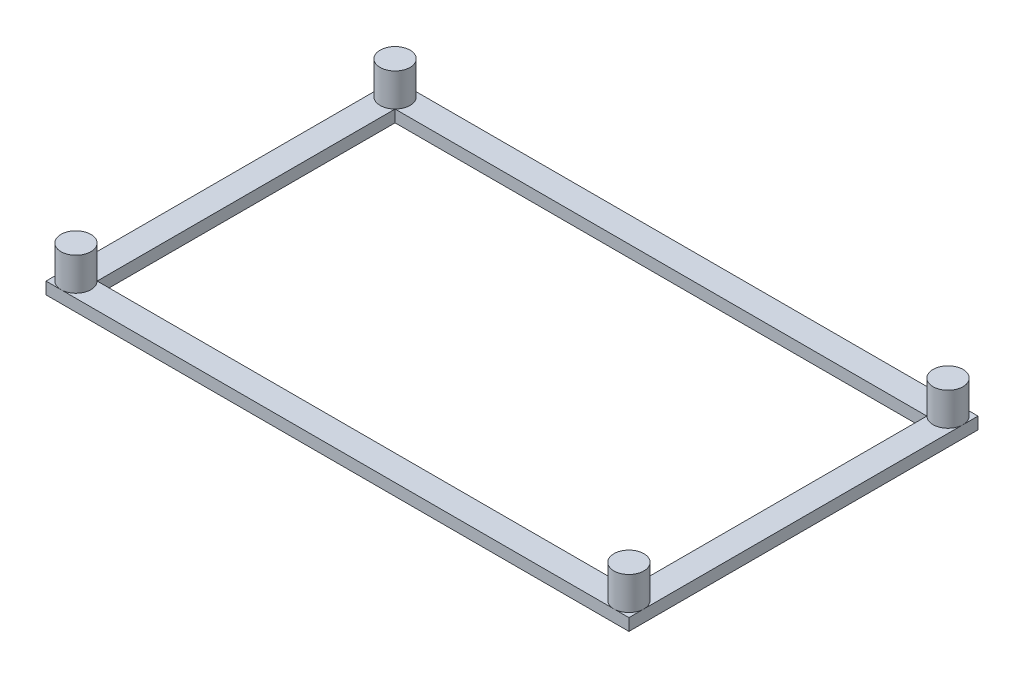
ISO-10303-21;
HEADER;
FILE_DESCRIPTION(('STEP AP214'),'2;1');
FILE_NAME('part.step','',(''),(''),'','','');
FILE_SCHEMA(('AUTOMOTIVE_DESIGN { 1 0 10303 214 1 1 1 1 }'));
ENDSEC;
DATA;
#1=APPLICATION_CONTEXT('core data for automotive mechanical design processes');
#2=APPLICATION_PROTOCOL_DEFINITION('international standard','automotive_design',2000,#1);
#3=PRODUCT_CONTEXT('',#1,'mechanical');
#4=PRODUCT('Part','Part','',(#3));
#5=PRODUCT_RELATED_PRODUCT_CATEGORY('part','',(#4));
#6=PRODUCT_DEFINITION_FORMATION('','',#4);
#7=PRODUCT_DEFINITION_CONTEXT('part definition',#1,'design');
#8=PRODUCT_DEFINITION('design','',#6,#7);
#9=PRODUCT_DEFINITION_SHAPE('','',#8);
#10=(LENGTH_UNIT() NAMED_UNIT(*) SI_UNIT(.MILLI.,.METRE.));
#11=(NAMED_UNIT(*) PLANE_ANGLE_UNIT() SI_UNIT($,.RADIAN.));
#12=(NAMED_UNIT(*) SI_UNIT($,.STERADIAN.) SOLID_ANGLE_UNIT());
#13=UNCERTAINTY_MEASURE_WITH_UNIT(LENGTH_MEASURE(1.E-05),#10,'distance_accuracy_value','');
#14=(GEOMETRIC_REPRESENTATION_CONTEXT(3) GLOBAL_UNCERTAINTY_ASSIGNED_CONTEXT((#13)) GLOBAL_UNIT_ASSIGNED_CONTEXT((#10,
#11,#12)) REPRESENTATION_CONTEXT('',''));
#15=CARTESIAN_POINT('',(0.,0.,0.));
#16=DIRECTION('',(0.,0.,1.));
#17=DIRECTION('',(1.,0.,0.));
#18=AXIS2_PLACEMENT_3D('',#15,#16,#17);
#19=CARTESIAN_POINT('',(0.,2.,0.));
#20=DIRECTION('',(0.,-1.,0.));
#21=DIRECTION('',(0.,0.,-1.));
#22=AXIS2_PLACEMENT_3D('',#19,#20,#21);
#23=PLANE('',#22);
#24=CARTESIAN_POINT('',(92.6585,2.,-115.9685));
#25=DIRECTION('',(0.,-1.,0.));
#26=DIRECTION('',(0.,0.,-1.));
#27=AXIS2_PLACEMENT_3D('',#24,#25,#26);
#28=CIRCLE('',#27,2.5);
#29=CARTESIAN_POINT('',(92.6585,2.,-118.4685));
#30=VERTEX_POINT('',#29);
#31=CARTESIAN_POINT('',(90.8907330470337,2.,-114.200733047034));
#32=VERTEX_POINT('',#31);
#33=EDGE_CURVE('E159',#30,#32,#28,.F.);
#34=ORIENTED_EDGE('',*,*,#33,.F.);
#35=DIRECTION('',(1.,0.,0.));
#36=VECTOR('',#35,1.);
#37=CARTESIAN_POINT('',(-2.15849993599998,2.,-118.4685));
#38=LINE('',#37,#36);
#39=CARTESIAN_POINT('',(0.341500064000022,2.,-118.4685));
#40=VERTEX_POINT('',#39);
#41=EDGE_CURVE('E140',#40,#30,#38,.T.);
#42=ORIENTED_EDGE('',*,*,#41,.F.);
#43=CARTESIAN_POINT('',(0.341500064000022,2.,-115.9685));
#44=DIRECTION('',(0.,-1.,0.));
#45=DIRECTION('',(0.,0.,-1.));
#46=AXIS2_PLACEMENT_3D('',#43,#44,#45);
#47=CIRCLE('',#46,2.5);
#48=CARTESIAN_POINT('',(2.10926701696639,2.,-114.200733047034));
#49=VERTEX_POINT('',#48);
#50=EDGE_CURVE('E173',#49,#40,#47,.F.);
#51=ORIENTED_EDGE('',*,*,#50,.F.);
#52=DIRECTION('',(1.,0.,0.));
#53=VECTOR('',#52,1.);
#54=CARTESIAN_POINT('',(2.10926701696639,2.,-114.200733047034));
#55=LINE('',#54,#53);
#56=EDGE_CURVE('E161',#49,#32,#55,.T.);
#57=ORIENTED_EDGE('',*,*,#56,.T.);
#58=EDGE_LOOP('',(#34,#42,#51,#57));
#59=FACE_BOUND('',#58,.T.);
#60=ADVANCED_FACE('F40',(#59),#23,.F.);
#61=CARTESIAN_POINT('',(95.1585,2.,-115.9685));
#62=VERTEX_POINT('',#61);
#63=EDGE_CURVE('E166',#32,#62,#28,.F.);
#64=ORIENTED_EDGE('',*,*,#63,.F.);
#65=DIRECTION('',(0.,0.,1.));
#66=VECTOR('',#65,1.);
#67=CARTESIAN_POINT('',(90.8907330470337,2.,-64.4592669529664));
#68=LINE('',#67,#66);
#69=CARTESIAN_POINT('',(90.8907330470337,2.,-64.4592669529664));
#70=VERTEX_POINT('',#69);
#71=EDGE_CURVE('E190',#32,#70,#68,.T.);
#72=ORIENTED_EDGE('',*,*,#71,.T.);
#73=CARTESIAN_POINT('',(92.6585,2.,-62.6915));
#74=DIRECTION('',(0.,-1.,0.));
#75=DIRECTION('',(0.,0.,-1.));
#76=AXIS2_PLACEMENT_3D('',#73,#74,#75);
#77=CIRCLE('',#76,2.5);
#78=CARTESIAN_POINT('',(95.1585,2.,-62.6915));
#79=VERTEX_POINT('',#78);
#80=EDGE_CURVE('E44',#70,#79,#77,.T.);
#81=ORIENTED_EDGE('',*,*,#80,.T.);
#82=DIRECTION('',(0.,0.,1.));
#83=VECTOR('',#82,1.);
#84=CARTESIAN_POINT('',(95.1585,2.,-60.1915));
#85=LINE('',#84,#83);
#86=EDGE_CURVE('E228',#62,#79,#85,.T.);
#87=ORIENTED_EDGE('',*,*,#86,.F.);
#88=EDGE_LOOP('',(#64,#72,#81,#87));
#89=FACE_BOUND('',#88,.T.);
#90=ADVANCED_FACE('F289',(#89),#23,.F.);
#91=CARTESIAN_POINT('',(-2.15849993599998,2.,-115.9685));
#92=VERTEX_POINT('',#91);
#93=EDGE_CURVE('E176',#40,#92,#47,.F.);
#94=ORIENTED_EDGE('',*,*,#93,.F.);
#95=CARTESIAN_POINT('',(-2.15849993599998,2.,-118.4685));
#96=VERTEX_POINT('',#95);
#97=EDGE_CURVE('E147',#96,#40,#38,.T.);
#98=ORIENTED_EDGE('',*,*,#97,.F.);
#99=DIRECTION('',(0.,0.,-1.));
#100=VECTOR('',#99,1.);
#101=CARTESIAN_POINT('',(-2.15849993599999,2.,-60.1915));
#102=LINE('',#101,#100);
#103=EDGE_CURVE('E223',#92,#96,#102,.T.);
#104=ORIENTED_EDGE('',*,*,#103,.F.);
#105=EDGE_LOOP('',(#94,#98,#104));
#106=FACE_BOUND('',#105,.T.);
#107=ADVANCED_FACE('F322',(#106),#23,.F.);
#108=EDGE_CURVE('E65',#92,#49,#47,.F.);
#109=ORIENTED_EDGE('',*,*,#108,.F.);
#110=CARTESIAN_POINT('',(-2.15849993599999,2.,-62.6915));
#111=VERTEX_POINT('',#110);
#112=EDGE_CURVE('E222',#111,#92,#102,.T.);
#113=ORIENTED_EDGE('',*,*,#112,.F.);
#114=CARTESIAN_POINT('',(0.341500064000022,2.,-62.6915));
#115=DIRECTION('',(0.,-1.,0.));
#116=DIRECTION('',(0.,0.,-1.));
#117=AXIS2_PLACEMENT_3D('',#114,#115,#116);
#118=CIRCLE('',#117,2.5);
#119=CARTESIAN_POINT('',(2.10926701696637,2.,-64.4592669529664));
#120=VERTEX_POINT('',#119);
#121=EDGE_CURVE('E180',#120,#111,#118,.F.);
#122=ORIENTED_EDGE('',*,*,#121,.F.);
#123=DIRECTION('',(0.,0.,-1.));
#124=VECTOR('',#123,1.);
#125=CARTESIAN_POINT('',(2.10926701696637,2.,-64.4592669529664));
#126=LINE('',#125,#124);
#127=EDGE_CURVE('E185',#120,#49,#126,.T.);
#128=ORIENTED_EDGE('',*,*,#127,.T.);
#129=EDGE_LOOP('',(#109,#113,#122,#128));
#130=FACE_BOUND('',#129,.T.);
#131=ADVANCED_FACE('F328',(#130),#23,.F.);
#132=CARTESIAN_POINT('',(0.341500064000022,2.,-60.1915));
#133=VERTEX_POINT('',#132);
#134=EDGE_CURVE('E183',#111,#133,#118,.F.);
#135=ORIENTED_EDGE('',*,*,#134,.F.);
#136=CARTESIAN_POINT('',(-2.15849993599999,2.,-60.1915));
#137=VERTEX_POINT('',#136);
#138=EDGE_CURVE('E156',#137,#111,#102,.T.);
#139=ORIENTED_EDGE('',*,*,#138,.F.);
#140=DIRECTION('',(-1.,0.,0.));
#141=VECTOR('',#140,1.);
#142=CARTESIAN_POINT('',(-2.15849993599999,2.,-60.1915));
#143=LINE('',#142,#141);
#144=EDGE_CURVE('E227',#133,#137,#143,.T.);
#145=ORIENTED_EDGE('',*,*,#144,.F.);
#146=EDGE_LOOP('',(#135,#139,#145));
#147=FACE_BOUND('',#146,.T.);
#148=ADVANCED_FACE('F313',(#147),#23,.F.);
#149=EDGE_CURVE('E184',#133,#120,#118,.F.);
#150=ORIENTED_EDGE('',*,*,#149,.F.);
#151=CARTESIAN_POINT('',(92.6585,2.,-60.1915));
#152=VERTEX_POINT('',#151);
#153=EDGE_CURVE('E234',#152,#133,#143,.T.);
#154=ORIENTED_EDGE('',*,*,#153,.F.);
#155=EDGE_CURVE('E11',#152,#70,#77,.T.);
#156=ORIENTED_EDGE('',*,*,#155,.T.);
#157=DIRECTION('',(-1.,0.,0.));
#158=VECTOR('',#157,1.);
#159=CARTESIAN_POINT('',(2.10926701696637,2.,-64.4592669529664));
#160=LINE('',#159,#158);
#161=EDGE_CURVE('E194',#70,#120,#160,.T.);
#162=ORIENTED_EDGE('',*,*,#161,.T.);
#163=EDGE_LOOP('',(#150,#154,#156,#162));
#164=FACE_BOUND('',#163,.T.);
#165=ADVANCED_FACE('F275',(#164),#23,.F.);
#166=CARTESIAN_POINT('',(92.6585,7.5,-62.6915));
#167=DIRECTION('',(0.,-1.,0.));
#168=DIRECTION('',(0.,0.,-1.));
#169=AXIS2_PLACEMENT_3D('',#166,#167,#168);
#170=CYLINDRICAL_SURFACE('',#169,2.5);
#171=CARTESIAN_POINT('',(92.6585,7.5,-62.6915));
#172=DIRECTION('',(0.,1.,0.));
#173=DIRECTION('',(0.,0.,1.));
#174=AXIS2_PLACEMENT_3D('',#171,#172,#173);
#175=CIRCLE('',#174,2.5);
#176=CARTESIAN_POINT('',(92.6585,7.5,-60.1915));
#177=VERTEX_POINT('',#176);
#178=EDGE_CURVE('E248',#177,#177,#175,.T.);
#179=ORIENTED_EDGE('',*,*,#178,.F.);
#180=EDGE_LOOP('',(#179));
#181=FACE_BOUND('',#180,.T.);
#182=ORIENTED_EDGE('',*,*,#155,.F.);
#183=EDGE_CURVE('E50',#79,#152,#77,.T.);
#184=ORIENTED_EDGE('',*,*,#183,.F.);
#185=ORIENTED_EDGE('',*,*,#80,.F.);
#186=EDGE_LOOP('',(#182,#184,#185));
#187=FACE_BOUND('',#186,.T.);
#188=ADVANCED_FACE('F42',(#181,#187),#170,.T.);
#189=CARTESIAN_POINT('',(0.,7.5,0.));
#190=DIRECTION('',(0.,1.,0.));
#191=DIRECTION('',(0.,0.,1.));
#192=AXIS2_PLACEMENT_3D('',#189,#190,#191);
#193=PLANE('',#192);
#194=ORIENTED_EDGE('',*,*,#178,.T.);
#195=EDGE_LOOP('',(#194));
#196=FACE_BOUND('',#195,.T.);
#197=ADVANCED_FACE('F348',(#196),#193,.T.);
#198=CARTESIAN_POINT('',(95.1585,2.,-60.1915));
#199=VERTEX_POINT('',#198);
#200=EDGE_CURVE('E225',#79,#199,#85,.T.);
#201=ORIENTED_EDGE('',*,*,#200,.F.);
#202=ORIENTED_EDGE('',*,*,#183,.T.);
#203=EDGE_CURVE('E229',#199,#152,#143,.T.);
#204=ORIENTED_EDGE('',*,*,#203,.F.);
#205=EDGE_LOOP('',(#201,#202,#204));
#206=FACE_BOUND('',#205,.T.);
#207=ADVANCED_FACE('F271',(#206),#23,.F.);
#208=CARTESIAN_POINT('',(-2.15849993599999,2.,-60.1915));
#209=DIRECTION('',(0.,0.,1.));
#210=DIRECTION('',(1.,0.,0.));
#211=AXIS2_PLACEMENT_3D('',#208,#209,#210);
#212=PLANE('',#211);
#213=ORIENTED_EDGE('',*,*,#153,.T.);
#214=ORIENTED_EDGE('',*,*,#144,.T.);
#215=DIRECTION('',(0.,-1.,0.));
#216=VECTOR('',#215,1.);
#217=CARTESIAN_POINT('',(-2.15849993599999,2.,-60.1915));
#218=LINE('',#217,#216);
#219=CARTESIAN_POINT('',(-2.15849993599999,0.,-60.1915));
#220=VERTEX_POINT('',#219);
#221=EDGE_CURVE('E245',#137,#220,#218,.T.);
#222=ORIENTED_EDGE('',*,*,#221,.T.);
#223=DIRECTION('',(-1.,0.,0.));
#224=VECTOR('',#223,1.);
#225=CARTESIAN_POINT('',(-2.15849993599999,0.,-60.1915));
#226=LINE('',#225,#224);
#227=CARTESIAN_POINT('',(95.1585,0.,-60.1915));
#228=VERTEX_POINT('',#227);
#229=EDGE_CURVE('E242',#228,#220,#226,.T.);
#230=ORIENTED_EDGE('',*,*,#229,.F.);
#231=DIRECTION('',(0.,-1.,0.));
#232=VECTOR('',#231,1.);
#233=CARTESIAN_POINT('',(95.1585,2.,-60.1915));
#234=LINE('',#233,#232);
#235=EDGE_CURVE('E249',#199,#228,#234,.T.);
#236=ORIENTED_EDGE('',*,*,#235,.F.);
#237=ORIENTED_EDGE('',*,*,#203,.T.);
#238=EDGE_LOOP('',(#213,#214,#222,#230,#236,#237));
#239=FACE_BOUND('',#238,.T.);
#240=ADVANCED_FACE('F282',(#239),#212,.T.);
#241=CARTESIAN_POINT('',(95.1585,2.,-60.1915));
#242=DIRECTION('',(1.,0.,0.));
#243=DIRECTION('',(0.,0.,-1.));
#244=AXIS2_PLACEMENT_3D('',#241,#242,#243);
#245=PLANE('',#244);
#246=CARTESIAN_POINT('',(95.1585,2.,-118.4685));
#247=VERTEX_POINT('',#246);
#248=EDGE_CURVE('E155',#247,#62,#85,.T.);
#249=ORIENTED_EDGE('',*,*,#248,.T.);
#250=ORIENTED_EDGE('',*,*,#86,.T.);
#251=ORIENTED_EDGE('',*,*,#200,.T.);
#252=ORIENTED_EDGE('',*,*,#235,.T.);
#253=DIRECTION('',(0.,0.,1.));
#254=VECTOR('',#253,1.);
#255=CARTESIAN_POINT('',(95.1585,0.,-60.1915));
#256=LINE('',#255,#254);
#257=CARTESIAN_POINT('',(95.1585,0.,-118.4685));
#258=VERTEX_POINT('',#257);
#259=EDGE_CURVE('E239',#258,#228,#256,.T.);
#260=ORIENTED_EDGE('',*,*,#259,.F.);
#261=DIRECTION('',(0.,-1.,0.));
#262=VECTOR('',#261,1.);
#263=CARTESIAN_POINT('',(95.1585,2.,-118.4685));
#264=LINE('',#263,#262);
#265=EDGE_CURVE('E253',#247,#258,#264,.T.);
#266=ORIENTED_EDGE('',*,*,#265,.F.);
#267=EDGE_LOOP('',(#249,#250,#251,#252,#260,#266));
#268=FACE_BOUND('',#267,.T.);
#269=ADVANCED_FACE('F286',(#268),#245,.T.);
#270=CARTESIAN_POINT('',(-2.15849993599999,2.,-60.1915));
#271=DIRECTION('',(-1.,0.,0.));
#272=DIRECTION('',(0.,0.,1.));
#273=AXIS2_PLACEMENT_3D('',#270,#271,#272);
#274=PLANE('',#273);
#275=ORIENTED_EDGE('',*,*,#112,.T.);
#276=ORIENTED_EDGE('',*,*,#103,.T.);
#277=DIRECTION('',(0.,-1.,0.));
#278=VECTOR('',#277,1.);
#279=CARTESIAN_POINT('',(-2.15849993599998,2.,-118.4685));
#280=LINE('',#279,#278);
#281=CARTESIAN_POINT('',(-2.15849993599998,0.,-118.4685));
#282=VERTEX_POINT('',#281);
#283=EDGE_CURVE('E233',#96,#282,#280,.T.);
#284=ORIENTED_EDGE('',*,*,#283,.T.);
#285=DIRECTION('',(0.,0.,-1.));
#286=VECTOR('',#285,1.);
#287=CARTESIAN_POINT('',(-2.15849993599999,0.,-60.1915));
#288=LINE('',#287,#286);
#289=EDGE_CURVE('E214',#220,#282,#288,.T.);
#290=ORIENTED_EDGE('',*,*,#289,.F.);
#291=ORIENTED_EDGE('',*,*,#221,.F.);
#292=ORIENTED_EDGE('',*,*,#138,.T.);
#293=EDGE_LOOP('',(#275,#276,#284,#290,#291,#292));
#294=FACE_BOUND('',#293,.T.);
#295=ADVANCED_FACE('F318',(#294),#274,.T.);
#296=CARTESIAN_POINT('',(-2.15849993599998,2.,-118.4685));
#297=DIRECTION('',(0.,0.,-1.));
#298=DIRECTION('',(-1.,0.,0.));
#299=AXIS2_PLACEMENT_3D('',#296,#297,#298);
#300=PLANE('',#299);
#301=ORIENTED_EDGE('',*,*,#41,.T.);
#302=EDGE_CURVE('E143',#30,#247,#38,.T.);
#303=ORIENTED_EDGE('',*,*,#302,.T.);
#304=ORIENTED_EDGE('',*,*,#265,.T.);
#305=DIRECTION('',(1.,0.,0.));
#306=VECTOR('',#305,1.);
#307=CARTESIAN_POINT('',(-2.15849993599998,0.,-118.4685));
#308=LINE('',#307,#306);
#309=EDGE_CURVE('E236',#282,#258,#308,.T.);
#310=ORIENTED_EDGE('',*,*,#309,.F.);
#311=ORIENTED_EDGE('',*,*,#283,.F.);
#312=ORIENTED_EDGE('',*,*,#97,.T.);
#313=EDGE_LOOP('',(#301,#303,#304,#310,#311,#312));
#314=FACE_BOUND('',#313,.T.);
#315=ADVANCED_FACE('F141',(#314),#300,.T.);
#316=EDGE_CURVE('E57',#62,#30,#28,.F.);
#317=ORIENTED_EDGE('',*,*,#316,.F.);
#318=ORIENTED_EDGE('',*,*,#248,.F.);
#319=ORIENTED_EDGE('',*,*,#302,.F.);
#320=EDGE_LOOP('',(#317,#318,#319));
#321=FACE_BOUND('',#320,.T.);
#322=ADVANCED_FACE('F153',(#321),#23,.F.);
#323=CARTESIAN_POINT('',(2.10926701696637,2.,-64.4592669529664));
#324=DIRECTION('',(-1.,0.,0.));
#325=DIRECTION('',(0.,0.,1.));
#326=AXIS2_PLACEMENT_3D('',#323,#324,#325);
#327=PLANE('',#326);
#328=DIRECTION('',(0.,0.,-1.));
#329=VECTOR('',#328,1.);
#330=CARTESIAN_POINT('',(2.10926701696637,0.,-64.4592669529664));
#331=LINE('',#330,#329);
#332=CARTESIAN_POINT('',(2.10926701696637,0.,-64.4592669529664));
#333=VERTEX_POINT('',#332);
#334=CARTESIAN_POINT('',(2.10926701696639,0.,-114.200733047034));
#335=VERTEX_POINT('',#334);
#336=EDGE_CURVE('E199',#333,#335,#331,.T.);
#337=ORIENTED_EDGE('',*,*,#336,.T.);
#338=DIRECTION('',(0.,-1.,0.));
#339=VECTOR('',#338,1.);
#340=CARTESIAN_POINT('',(2.10926701696639,2.,-114.200733047034));
#341=LINE('',#340,#339);
#342=EDGE_CURVE('E198',#49,#335,#341,.T.);
#343=ORIENTED_EDGE('',*,*,#342,.F.);
#344=ORIENTED_EDGE('',*,*,#127,.F.);
#345=DIRECTION('',(0.,-1.,0.));
#346=VECTOR('',#345,1.);
#347=CARTESIAN_POINT('',(2.10926701696637,2.,-64.4592669529664));
#348=LINE('',#347,#346);
#349=EDGE_CURVE('E212',#120,#333,#348,.T.);
#350=ORIENTED_EDGE('',*,*,#349,.T.);
#351=EDGE_LOOP('',(#337,#343,#344,#350));
#352=FACE_BOUND('',#351,.T.);
#353=ADVANCED_FACE('F327',(#352),#327,.F.);
#354=CARTESIAN_POINT('',(2.10926701696637,2.,-64.4592669529664));
#355=DIRECTION('',(0.,0.,1.));
#356=DIRECTION('',(1.,0.,0.));
#357=AXIS2_PLACEMENT_3D('',#354,#355,#356);
#358=PLANE('',#357);
#359=DIRECTION('',(-1.,0.,0.));
#360=VECTOR('',#359,1.);
#361=CARTESIAN_POINT('',(2.10926701696637,0.,-64.4592669529664));
#362=LINE('',#361,#360);
#363=CARTESIAN_POINT('',(90.8907330470337,0.,-64.4592669529664));
#364=VERTEX_POINT('',#363);
#365=EDGE_CURVE('E187',#364,#333,#362,.T.);
#366=ORIENTED_EDGE('',*,*,#365,.T.);
#367=ORIENTED_EDGE('',*,*,#349,.F.);
#368=ORIENTED_EDGE('',*,*,#161,.F.);
#369=DIRECTION('',(0.,-1.,0.));
#370=VECTOR('',#369,1.);
#371=CARTESIAN_POINT('',(90.8907330470337,2.,-64.4592669529664));
#372=LINE('',#371,#370);
#373=EDGE_CURVE('E215',#70,#364,#372,.T.);
#374=ORIENTED_EDGE('',*,*,#373,.T.);
#375=EDGE_LOOP('',(#366,#367,#368,#374));
#376=FACE_BOUND('',#375,.T.);
#377=ADVANCED_FACE('F306',(#376),#358,.F.);
#378=CARTESIAN_POINT('',(90.8907330470337,2.,-64.4592669529664));
#379=DIRECTION('',(1.,0.,0.));
#380=DIRECTION('',(0.,0.,-1.));
#381=AXIS2_PLACEMENT_3D('',#378,#379,#380);
#382=PLANE('',#381);
#383=DIRECTION('',(0.,0.,1.));
#384=VECTOR('',#383,1.);
#385=CARTESIAN_POINT('',(90.8907330470337,0.,-64.4592669529664));
#386=LINE('',#385,#384);
#387=CARTESIAN_POINT('',(90.8907330470337,0.,-114.200733047034));
#388=VERTEX_POINT('',#387);
#389=EDGE_CURVE('E205',#388,#364,#386,.T.);
#390=ORIENTED_EDGE('',*,*,#389,.T.);
#391=ORIENTED_EDGE('',*,*,#373,.F.);
#392=ORIENTED_EDGE('',*,*,#71,.F.);
#393=DIRECTION('',(0.,-1.,0.));
#394=VECTOR('',#393,1.);
#395=CARTESIAN_POINT('',(90.8907330470337,2.,-114.200733047034));
#396=LINE('',#395,#394);
#397=EDGE_CURVE('E218',#32,#388,#396,.T.);
#398=ORIENTED_EDGE('',*,*,#397,.T.);
#399=EDGE_LOOP('',(#390,#391,#392,#398));
#400=FACE_BOUND('',#399,.T.);
#401=ADVANCED_FACE('F293',(#400),#382,.F.);
#402=CARTESIAN_POINT('',(2.10926701696639,2.,-114.200733047034));
#403=DIRECTION('',(0.,0.,-1.));
#404=DIRECTION('',(-1.,0.,0.));
#405=AXIS2_PLACEMENT_3D('',#402,#403,#404);
#406=PLANE('',#405);
#407=DIRECTION('',(1.,0.,0.));
#408=VECTOR('',#407,1.);
#409=CARTESIAN_POINT('',(2.10926701696639,0.,-114.200733047034));
#410=LINE('',#409,#408);
#411=EDGE_CURVE('E201',#335,#388,#410,.T.);
#412=ORIENTED_EDGE('',*,*,#411,.T.);
#413=ORIENTED_EDGE('',*,*,#397,.F.);
#414=ORIENTED_EDGE('',*,*,#56,.F.);
#415=ORIENTED_EDGE('',*,*,#342,.T.);
#416=EDGE_LOOP('',(#412,#413,#414,#415));
#417=FACE_BOUND('',#416,.T.);
#418=ADVANCED_FACE('F296',(#417),#406,.F.);
#419=CARTESIAN_POINT('',(0.,0.,0.));
#420=DIRECTION('',(0.,1.,0.));
#421=DIRECTION('',(0.,0.,1.));
#422=AXIS2_PLACEMENT_3D('',#419,#420,#421);
#423=PLANE('',#422);
#424=ORIENTED_EDGE('',*,*,#309,.T.);
#425=ORIENTED_EDGE('',*,*,#259,.T.);
#426=ORIENTED_EDGE('',*,*,#229,.T.);
#427=ORIENTED_EDGE('',*,*,#289,.T.);
#428=EDGE_LOOP('',(#424,#425,#426,#427));
#429=FACE_BOUND('',#428,.T.);
#430=ORIENTED_EDGE('',*,*,#389,.F.);
#431=ORIENTED_EDGE('',*,*,#411,.F.);
#432=ORIENTED_EDGE('',*,*,#336,.F.);
#433=ORIENTED_EDGE('',*,*,#365,.F.);
#434=EDGE_LOOP('',(#430,#431,#432,#433));
#435=FACE_BOUND('',#434,.T.);
#436=ADVANCED_FACE('F303',(#429,#435),#423,.F.);
#437=CARTESIAN_POINT('',(0.341500064000022,7.5,-62.6915));
#438=DIRECTION('',(0.,-1.,0.));
#439=DIRECTION('',(0.,0.,-1.));
#440=AXIS2_PLACEMENT_3D('',#437,#438,#439);
#441=CYLINDRICAL_SURFACE('',#440,2.5);
#442=CARTESIAN_POINT('',(0.341500064000022,7.5,-62.6915));
#443=DIRECTION('',(0.,1.,0.));
#444=DIRECTION('',(0.,0.,1.));
#445=AXIS2_PLACEMENT_3D('',#442,#443,#444);
#446=CIRCLE('',#445,2.5);
#447=CARTESIAN_POINT('',(0.341500064000022,7.5,-60.1915));
#448=VERTEX_POINT('',#447);
#449=EDGE_CURVE('E177',#448,#448,#446,.T.);
#450=ORIENTED_EDGE('',*,*,#449,.F.);
#451=EDGE_LOOP('',(#450));
#452=FACE_BOUND('',#451,.T.);
#453=ORIENTED_EDGE('',*,*,#134,.T.);
#454=ORIENTED_EDGE('',*,*,#149,.T.);
#455=ORIENTED_EDGE('',*,*,#121,.T.);
#456=EDGE_LOOP('',(#453,#454,#455));
#457=FACE_BOUND('',#456,.T.);
#458=ADVANCED_FACE('F309',(#452,#457),#441,.T.);
#459=CARTESIAN_POINT('',(0.,7.5,0.));
#460=DIRECTION('',(0.,1.,0.));
#461=DIRECTION('',(0.,0.,1.));
#462=AXIS2_PLACEMENT_3D('',#459,#460,#461);
#463=PLANE('',#462);
#464=ORIENTED_EDGE('',*,*,#449,.T.);
#465=EDGE_LOOP('',(#464));
#466=FACE_BOUND('',#465,.T.);
#467=ADVANCED_FACE('F473',(#466),#463,.T.);
#468=CARTESIAN_POINT('',(0.341500064000022,7.5,-115.9685));
#469=DIRECTION('',(0.,-1.,0.));
#470=DIRECTION('',(0.,0.,-1.));
#471=AXIS2_PLACEMENT_3D('',#468,#469,#470);
#472=CYLINDRICAL_SURFACE('',#471,2.5);
#473=CARTESIAN_POINT('',(0.341500064000022,7.5,-115.9685));
#474=DIRECTION('',(0.,1.,0.));
#475=DIRECTION('',(0.,0.,1.));
#476=AXIS2_PLACEMENT_3D('',#473,#474,#475);
#477=CIRCLE('',#476,2.5);
#478=CARTESIAN_POINT('',(0.341500064000022,7.5,-113.4685));
#479=VERTEX_POINT('',#478);
#480=EDGE_CURVE('E164',#479,#479,#477,.T.);
#481=ORIENTED_EDGE('',*,*,#480,.F.);
#482=EDGE_LOOP('',(#481));
#483=FACE_BOUND('',#482,.T.);
#484=ORIENTED_EDGE('',*,*,#93,.T.);
#485=ORIENTED_EDGE('',*,*,#108,.T.);
#486=ORIENTED_EDGE('',*,*,#50,.T.);
#487=EDGE_LOOP('',(#484,#485,#486));
#488=FACE_BOUND('',#487,.T.);
#489=ADVANCED_FACE('F325',(#483,#488),#472,.T.);
#490=CARTESIAN_POINT('',(0.,7.5,0.));
#491=DIRECTION('',(0.,1.,0.));
#492=DIRECTION('',(0.,0.,1.));
#493=AXIS2_PLACEMENT_3D('',#490,#491,#492);
#494=PLANE('',#493);
#495=ORIENTED_EDGE('',*,*,#480,.T.);
#496=EDGE_LOOP('',(#495));
#497=FACE_BOUND('',#496,.T.);
#498=ADVANCED_FACE('F492',(#497),#494,.T.);
#499=CARTESIAN_POINT('',(92.6585,7.5,-115.9685));
#500=DIRECTION('',(0.,-1.,0.));
#501=DIRECTION('',(0.,0.,-1.));
#502=AXIS2_PLACEMENT_3D('',#499,#500,#501);
#503=CYLINDRICAL_SURFACE('',#502,2.5);
#504=CARTESIAN_POINT('',(92.6585,7.5,-115.9685));
#505=DIRECTION('',(0.,1.,0.));
#506=DIRECTION('',(0.,0.,1.));
#507=AXIS2_PLACEMENT_3D('',#504,#505,#506);
#508=CIRCLE('',#507,2.5);
#509=CARTESIAN_POINT('',(92.6585,7.5,-113.4685));
#510=VERTEX_POINT('',#509);
#511=EDGE_CURVE('E168',#510,#510,#508,.T.);
#512=ORIENTED_EDGE('',*,*,#511,.F.);
#513=EDGE_LOOP('',(#512));
#514=FACE_BOUND('',#513,.T.);
#515=ORIENTED_EDGE('',*,*,#316,.T.);
#516=ORIENTED_EDGE('',*,*,#33,.T.);
#517=ORIENTED_EDGE('',*,*,#63,.T.);
#518=EDGE_LOOP('',(#515,#516,#517));
#519=FACE_BOUND('',#518,.T.);
#520=ADVANCED_FACE('F167',(#514,#519),#503,.T.);
#521=CARTESIAN_POINT('',(0.,7.5,0.));
#522=DIRECTION('',(0.,1.,0.));
#523=DIRECTION('',(0.,0.,1.));
#524=AXIS2_PLACEMENT_3D('',#521,#522,#523);
#525=PLANE('',#524);
#526=ORIENTED_EDGE('',*,*,#511,.T.);
#527=EDGE_LOOP('',(#526));
#528=FACE_BOUND('',#527,.T.);
#529=ADVANCED_FACE('F511',(#528),#525,.T.);
#530=CLOSED_SHELL('',(#60,#90,#107,#131,#148,#165,#188,#197,#207,#240,#269,#295,#315,#322,#353,
#377,#401,#418,#436,#458,#467,#489,#498,#520,#529));
#531=MANIFOLD_SOLID_BREP('B2',#530);
#532=ADVANCED_BREP_SHAPE_REPRESENTATION('',(#18,#531),#14);
#533=SHAPE_DEFINITION_REPRESENTATION(#9,#532);
ENDSEC;
END-ISO-10303-21;
